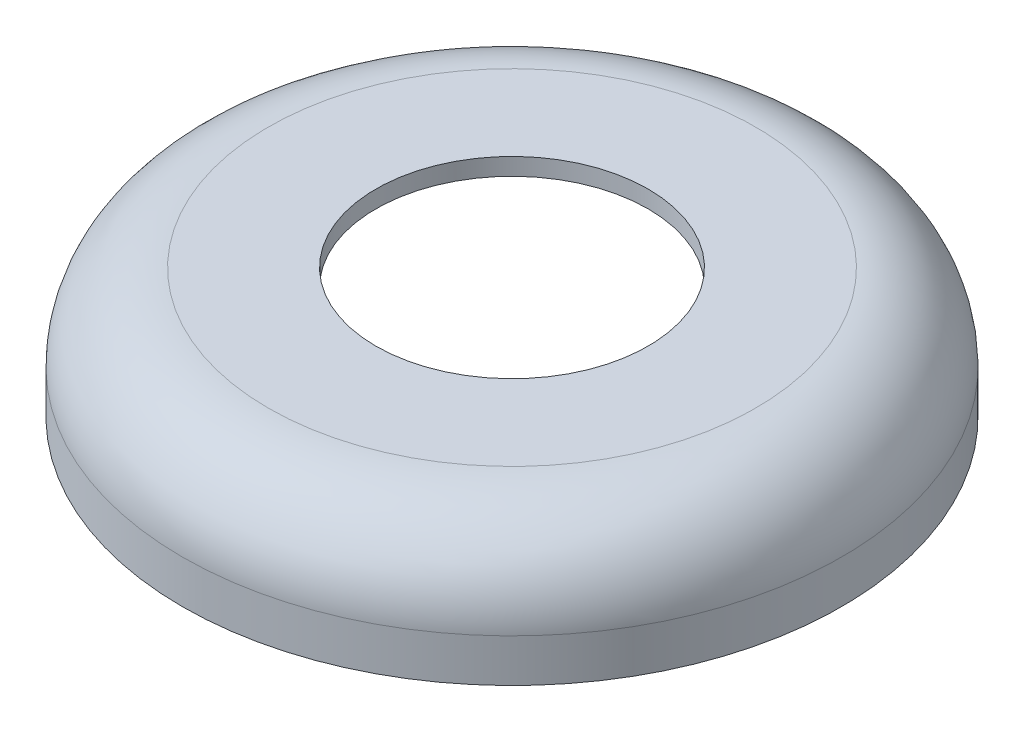
ISO-10303-21;
HEADER;
FILE_DESCRIPTION(('STEP AP214'),'2;1');
FILE_NAME('part.step','',(''),(''),'','','');
FILE_SCHEMA(('AUTOMOTIVE_DESIGN { 1 0 10303 214 1 1 1 1 }'));
ENDSEC;
DATA;
#1=APPLICATION_CONTEXT('core data for automotive mechanical design processes');
#2=APPLICATION_PROTOCOL_DEFINITION('international standard','automotive_design',2000,#1);
#3=PRODUCT_CONTEXT('',#1,'mechanical');
#4=PRODUCT('Part','Part','',(#3));
#5=PRODUCT_RELATED_PRODUCT_CATEGORY('part','',(#4));
#6=PRODUCT_DEFINITION_FORMATION('','',#4);
#7=PRODUCT_DEFINITION_CONTEXT('part definition',#1,'design');
#8=PRODUCT_DEFINITION('design','',#6,#7);
#9=PRODUCT_DEFINITION_SHAPE('','',#8);
#10=(LENGTH_UNIT() NAMED_UNIT(*) SI_UNIT(.MILLI.,.METRE.));
#11=(NAMED_UNIT(*) PLANE_ANGLE_UNIT() SI_UNIT($,.RADIAN.));
#12=(NAMED_UNIT(*) SI_UNIT($,.STERADIAN.) SOLID_ANGLE_UNIT());
#13=UNCERTAINTY_MEASURE_WITH_UNIT(LENGTH_MEASURE(1.E-05),#10,'distance_accuracy_value','');
#14=(GEOMETRIC_REPRESENTATION_CONTEXT(3) GLOBAL_UNCERTAINTY_ASSIGNED_CONTEXT((#13)) GLOBAL_UNIT_ASSIGNED_CONTEXT((#10,
#11,#12)) REPRESENTATION_CONTEXT('',''));
#15=CARTESIAN_POINT('',(0.,0.,0.));
#16=DIRECTION('',(0.,0.,1.));
#17=DIRECTION('',(1.,0.,0.));
#18=AXIS2_PLACEMENT_3D('',#15,#16,#17);
#19=CARTESIAN_POINT('',(0.,4.5,0.));
#20=DIRECTION('',(0.,-1.,0.));
#21=DIRECTION('',(0.,0.,-1.));
#22=AXIS2_PLACEMENT_3D('',#19,#20,#21);
#23=CYLINDRICAL_SURFACE('',#22,11.5);
#24=CARTESIAN_POINT('',(0.,1.5,0.));
#25=DIRECTION('',(0.,1.,0.));
#26=DIRECTION('',(0.,0.,1.));
#27=AXIS2_PLACEMENT_3D('',#24,#25,#26);
#28=CIRCLE('',#27,11.5);
#29=CARTESIAN_POINT('',(0.,1.5,11.5));
#30=VERTEX_POINT('',#29);
#31=EDGE_CURVE('E10',#30,#30,#28,.F.);
#32=ORIENTED_EDGE('',*,*,#31,.T.);
#33=EDGE_LOOP('',(#32));
#34=FACE_BOUND('',#33,.T.);
#35=CARTESIAN_POINT('',(0.,0.,0.));
#36=DIRECTION('',(0.,1.,0.));
#37=DIRECTION('',(0.,0.,1.));
#38=AXIS2_PLACEMENT_3D('',#35,#36,#37);
#39=CIRCLE('',#38,11.5);
#40=CARTESIAN_POINT('',(0.,0.,11.5));
#41=VERTEX_POINT('',#40);
#42=EDGE_CURVE('E44',#41,#41,#39,.T.);
#43=ORIENTED_EDGE('',*,*,#42,.T.);
#44=EDGE_LOOP('',(#43));
#45=FACE_BOUND('',#44,.T.);
#46=ADVANCED_FACE('F32',(#34,#45),#23,.T.);
#47=CARTESIAN_POINT('',(0.,4.5,0.));
#48=DIRECTION('',(0.,1.,0.));
#49=DIRECTION('',(0.,0.,1.));
#50=AXIS2_PLACEMENT_3D('',#47,#48,#49);
#51=PLANE('',#50);
#52=CARTESIAN_POINT('',(0.,4.5,0.));
#53=DIRECTION('',(0.,1.,0.));
#54=DIRECTION('',(0.,0.,1.));
#55=AXIS2_PLACEMENT_3D('',#52,#53,#54);
#56=CIRCLE('',#55,4.75);
#57=CARTESIAN_POINT('',(0.,4.5,4.75));
#58=VERTEX_POINT('',#57);
#59=EDGE_CURVE('E58',#58,#58,#56,.T.);
#60=ORIENTED_EDGE('',*,*,#59,.F.);
#61=EDGE_LOOP('',(#60));
#62=FACE_BOUND('',#61,.T.);
#63=CARTESIAN_POINT('',(0.,4.5,0.));
#64=DIRECTION('',(0.,1.,0.));
#65=DIRECTION('',(0.,0.,1.));
#66=AXIS2_PLACEMENT_3D('',#63,#64,#65);
#67=CIRCLE('',#66,8.5);
#68=CARTESIAN_POINT('',(0.,4.5,8.5));
#69=VERTEX_POINT('',#68);
#70=EDGE_CURVE('E40',#69,#69,#67,.T.);
#71=ORIENTED_EDGE('',*,*,#70,.T.);
#72=EDGE_LOOP('',(#71));
#73=FACE_BOUND('',#72,.T.);
#74=ADVANCED_FACE('F79',(#62,#73),#51,.T.);
#75=CARTESIAN_POINT('',(0.,0.,0.));
#76=DIRECTION('',(0.,1.,0.));
#77=DIRECTION('',(0.,0.,1.));
#78=AXIS2_PLACEMENT_3D('',#75,#76,#77);
#79=PLANE('',#78);
#80=CARTESIAN_POINT('',(0.,0.,0.));
#81=DIRECTION('',(0.,1.,0.));
#82=DIRECTION('',(0.,0.,1.));
#83=AXIS2_PLACEMENT_3D('',#80,#81,#82);
#84=CIRCLE('',#83,10.9);
#85=CARTESIAN_POINT('',(0.,0.,10.9));
#86=VERTEX_POINT('',#85);
#87=EDGE_CURVE('E50',#86,#86,#84,.T.);
#88=ORIENTED_EDGE('',*,*,#87,.T.);
#89=EDGE_LOOP('',(#88));
#90=FACE_BOUND('',#89,.T.);
#91=ORIENTED_EDGE('',*,*,#42,.F.);
#92=EDGE_LOOP('',(#91));
#93=FACE_BOUND('',#92,.T.);
#94=ADVANCED_FACE('F83',(#90,#93),#79,.F.);
#95=CARTESIAN_POINT('',(0.,1.5,0.));
#96=DIRECTION('',(0.,1.,0.));
#97=DIRECTION('',(0.,0.,1.));
#98=AXIS2_PLACEMENT_3D('',#95,#96,#97);
#99=TOROIDAL_SURFACE('',#98,8.5,3.);
#100=ORIENTED_EDGE('',*,*,#31,.F.);
#101=EDGE_LOOP('',(#100));
#102=FACE_BOUND('',#101,.T.);
#103=ORIENTED_EDGE('',*,*,#70,.F.);
#104=EDGE_LOOP('',(#103));
#105=FACE_BOUND('',#104,.T.);
#106=ADVANCED_FACE('F34',(#102,#105),#99,.T.);
#107=CARTESIAN_POINT('',(0.,4.5,0.));
#108=DIRECTION('',(0.,-1.,0.));
#109=DIRECTION('',(0.,0.,-1.));
#110=AXIS2_PLACEMENT_3D('',#107,#108,#109);
#111=CYLINDRICAL_SURFACE('',#110,10.9);
#112=CARTESIAN_POINT('',(0.,1.5,0.));
#113=DIRECTION('',(0.,-1.,0.));
#114=DIRECTION('',(0.,0.,-1.));
#115=AXIS2_PLACEMENT_3D('',#112,#113,#114);
#116=CIRCLE('',#115,10.9);
#117=CARTESIAN_POINT('',(0.,1.5,-10.9));
#118=VERTEX_POINT('',#117);
#119=EDGE_CURVE('E49',#118,#118,#116,.T.);
#120=ORIENTED_EDGE('',*,*,#119,.F.);
#121=EDGE_LOOP('',(#120));
#122=FACE_BOUND('',#121,.T.);
#123=ORIENTED_EDGE('',*,*,#87,.F.);
#124=EDGE_LOOP('',(#123));
#125=FACE_BOUND('',#124,.T.);
#126=ADVANCED_FACE('F92',(#122,#125),#111,.F.);
#127=CARTESIAN_POINT('',(0.,3.9,0.));
#128=DIRECTION('',(0.,1.,0.));
#129=DIRECTION('',(0.,0.,1.));
#130=AXIS2_PLACEMENT_3D('',#127,#128,#129);
#131=PLANE('',#130);
#132=CARTESIAN_POINT('',(0.,3.9,0.));
#133=DIRECTION('',(0.,1.,0.));
#134=DIRECTION('',(0.,0.,1.));
#135=AXIS2_PLACEMENT_3D('',#132,#133,#134);
#136=CIRCLE('',#135,4.75);
#137=CARTESIAN_POINT('',(0.,3.9,4.75));
#138=VERTEX_POINT('',#137);
#139=EDGE_CURVE('E36',#138,#138,#136,.T.);
#140=ORIENTED_EDGE('',*,*,#139,.T.);
#141=EDGE_LOOP('',(#140));
#142=FACE_BOUND('',#141,.T.);
#143=CARTESIAN_POINT('',(0.,3.9,0.));
#144=DIRECTION('',(0.,1.,0.));
#145=DIRECTION('',(0.,0.,1.));
#146=AXIS2_PLACEMENT_3D('',#143,#144,#145);
#147=CIRCLE('',#146,8.5);
#148=CARTESIAN_POINT('',(0.,3.9,8.5));
#149=VERTEX_POINT('',#148);
#150=EDGE_CURVE('E53',#149,#149,#147,.T.);
#151=ORIENTED_EDGE('',*,*,#150,.F.);
#152=EDGE_LOOP('',(#151));
#153=FACE_BOUND('',#152,.T.);
#154=ADVANCED_FACE('F65',(#142,#153),#131,.F.);
#155=CARTESIAN_POINT('',(0.,1.5,0.));
#156=DIRECTION('',(0.,1.,0.));
#157=DIRECTION('',(0.,0.,1.));
#158=AXIS2_PLACEMENT_3D('',#155,#156,#157);
#159=TOROIDAL_SURFACE('',#158,8.5,2.4);
#160=ORIENTED_EDGE('',*,*,#119,.T.);
#161=EDGE_LOOP('',(#160));
#162=FACE_BOUND('',#161,.T.);
#163=ORIENTED_EDGE('',*,*,#150,.T.);
#164=EDGE_LOOP('',(#163));
#165=FACE_BOUND('',#164,.T.);
#166=ADVANCED_FACE('F70',(#162,#165),#159,.F.);
#167=CARTESIAN_POINT('',(0.,0.,0.));
#168=DIRECTION('',(0.,1.,0.));
#169=DIRECTION('',(0.,0.,1.));
#170=AXIS2_PLACEMENT_3D('',#167,#168,#169);
#171=CYLINDRICAL_SURFACE('',#170,4.75);
#172=ORIENTED_EDGE('',*,*,#59,.T.);
#173=EDGE_LOOP('',(#172));
#174=FACE_BOUND('',#173,.T.);
#175=ORIENTED_EDGE('',*,*,#139,.F.);
#176=EDGE_LOOP('',(#175));
#177=FACE_BOUND('',#176,.T.);
#178=ADVANCED_FACE('F68',(#174,#177),#171,.F.);
#179=CLOSED_SHELL('',(#46,#74,#94,#106,#126,#154,#166,#178));
#180=MANIFOLD_SOLID_BREP('B2',#179);
#181=ADVANCED_BREP_SHAPE_REPRESENTATION('',(#18,#180),#14);
#182=SHAPE_DEFINITION_REPRESENTATION(#9,#181);
ENDSEC;
END-ISO-10303-21;
